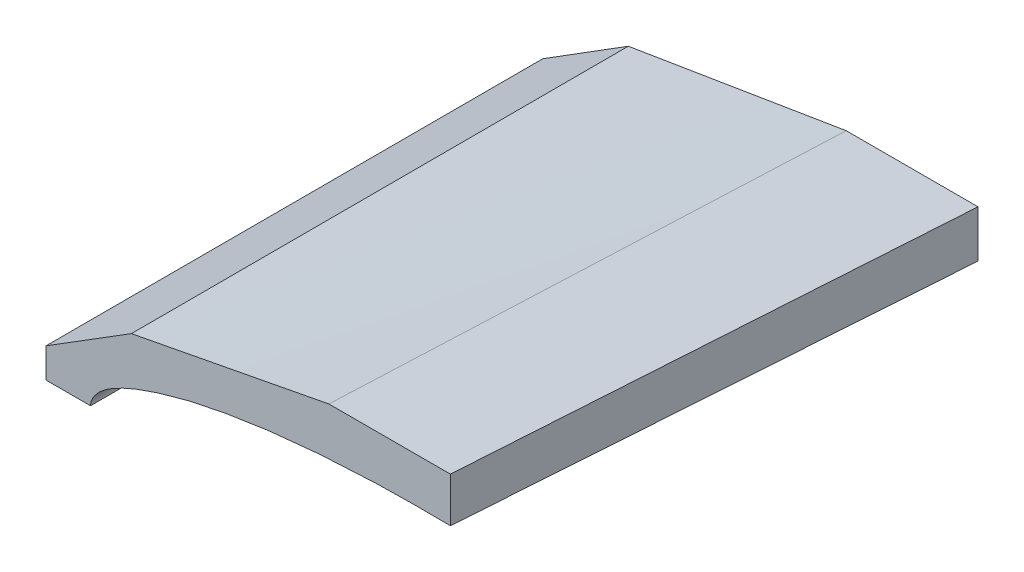
ISO-10303-21;
HEADER;
FILE_DESCRIPTION(('STEP AP214'),'2;1');
FILE_NAME('part.step','',(''),(''),'','','');
FILE_SCHEMA(('AUTOMOTIVE_DESIGN { 1 0 10303 214 1 1 1 1 }'));
ENDSEC;
DATA;
#1=APPLICATION_CONTEXT('core data for automotive mechanical design processes');
#2=APPLICATION_PROTOCOL_DEFINITION('international standard','automotive_design',2000,#1);
#3=PRODUCT_CONTEXT('',#1,'mechanical');
#4=PRODUCT('Part','Part','',(#3));
#5=PRODUCT_RELATED_PRODUCT_CATEGORY('part','',(#4));
#6=PRODUCT_DEFINITION_FORMATION('','',#4);
#7=PRODUCT_DEFINITION_CONTEXT('part definition',#1,'design');
#8=PRODUCT_DEFINITION('design','',#6,#7);
#9=PRODUCT_DEFINITION_SHAPE('','',#8);
#10=(LENGTH_UNIT() NAMED_UNIT(*) SI_UNIT(.MILLI.,.METRE.));
#11=(NAMED_UNIT(*) PLANE_ANGLE_UNIT() SI_UNIT($,.RADIAN.));
#12=(NAMED_UNIT(*) SI_UNIT($,.STERADIAN.) SOLID_ANGLE_UNIT());
#13=UNCERTAINTY_MEASURE_WITH_UNIT(LENGTH_MEASURE(1.E-05),#10,'distance_accuracy_value','');
#14=(GEOMETRIC_REPRESENTATION_CONTEXT(3) GLOBAL_UNCERTAINTY_ASSIGNED_CONTEXT((#13)) GLOBAL_UNIT_ASSIGNED_CONTEXT((#10,
#11,#12)) REPRESENTATION_CONTEXT('',''));
#15=CARTESIAN_POINT('',(0.,0.,0.));
#16=DIRECTION('',(0.,0.,1.));
#17=DIRECTION('',(1.,0.,0.));
#18=AXIS2_PLACEMENT_3D('',#15,#16,#17);
#19=CARTESIAN_POINT('',(0.,0.,619.76));
#20=DIRECTION('',(0.,0.,-1.));
#21=DIRECTION('',(-1.,0.,0.));
#22=AXIS2_PLACEMENT_3D('',#19,#20,#21);
#23=PLANE('',#22);
#24=CARTESIAN_POINT('',(16.665960034107,22.8320759672696,619.76));
#25=CARTESIAN_POINT('',(16.6659227791784,22.9515343249926,619.76));
#26=CARTESIAN_POINT('',(16.6723344853839,23.0708661366521,619.76));
#27=CARTESIAN_POINT('',(16.6967539549333,23.3080479413481,619.76));
#28=CARTESIAN_POINT('',(16.714732017644,23.4259009437427,619.76));
#29=CARTESIAN_POINT('',(16.7606665554886,23.6578573724142,619.76));
#30=CARTESIAN_POINT('',(16.7884776347151,23.7719902817547,619.76));
#31=CARTESIAN_POINT('',(16.852866783448,23.9978212473647,619.76));
#32=CARTESIAN_POINT('',(16.8894517901836,24.1095173002751,619.76));
#33=CARTESIAN_POINT('',(16.9913973640337,24.3880103026636,619.76));
#34=CARTESIAN_POINT('',(17.0617844741122,24.552969114425,619.76));
#35=CARTESIAN_POINT('',(17.2166279761935,24.8760930485377,619.76));
#36=CARTESIAN_POINT('',(17.3010898384224,25.0342554992669,619.76));
#37=CARTESIAN_POINT('',(17.4820774489066,25.3452475680357,619.76));
#38=CARTESIAN_POINT('',(17.5786984729781,25.498021306276,619.76));
#39=CARTESIAN_POINT('',(17.7812845603843,25.7971862555646,619.76));
#40=CARTESIAN_POINT('',(17.8872493060126,25.9435776833725,619.76));
#41=CARTESIAN_POINT('',(18.1050876751946,26.2280245366521,619.76));
#42=CARTESIAN_POINT('',(18.2168338887334,26.3661780454593,619.76));
#43=CARTESIAN_POINT('',(18.4466732242986,26.6371271944005,619.76));
#44=CARTESIAN_POINT('',(18.5647675907342,26.7699217750422,619.76));
#45=CARTESIAN_POINT('',(18.806488073043,27.0305262184775,619.76));
#46=CARTESIAN_POINT('',(18.9301178003879,27.1583327220319,619.76));
#47=CARTESIAN_POINT('',(19.182181427235,27.40911965662,619.76));
#48=CARTESIAN_POINT('',(19.3106155622858,27.532099850424,619.76));
#49=CARTESIAN_POINT('',(19.5716591482447,27.7732687536413,619.76));
#50=CARTESIAN_POINT('',(19.7042642380911,27.8914621902938,619.76));
#51=CARTESIAN_POINT('',(19.9734226606324,28.1232614578912,619.76));
#52=CARTESIAN_POINT('',(20.1099759920288,28.2368672903448,619.76));
#53=CARTESIAN_POINT('',(20.3867296777164,28.4593579014742,619.76));
#54=CARTESIAN_POINT('',(20.5269276161198,28.5682456860406,619.76));
#55=CARTESIAN_POINT('',(20.8107967837909,28.7813887484897,619.76));
#56=CARTESIAN_POINT('',(20.9544680046136,28.8856440376343,619.76));
#57=CARTESIAN_POINT('',(21.271079431314,29.1080182717573,619.76));
#58=CARTESIAN_POINT('',(21.444636677757,29.2252585687485,619.76));
#59=CARTESIAN_POINT('',(21.7955193560897,29.4539527402285,619.76));
#60=CARTESIAN_POINT('',(21.9728449415277,29.5654063782889,619.76));
#61=CARTESIAN_POINT('',(22.3307730192864,29.783383900817,619.76));
#62=CARTESIAN_POINT('',(22.51137909715,29.8899018752347,619.76));
#63=CARTESIAN_POINT('',(22.8749958887722,30.0987550806926,619.76));
#64=CARTESIAN_POINT('',(23.0580067084043,30.2010901267505,619.76));
#65=CARTESIAN_POINT('',(23.4263151593136,30.4024462433536,619.76));
#66=CARTESIAN_POINT('',(23.6116166565443,30.501460218106,619.76));
#67=CARTESIAN_POINT('',(23.983628222924,30.6967981121798,619.76));
#68=CARTESIAN_POINT('',(24.1703382900319,30.7931220353984,619.76));
#69=CARTESIAN_POINT('',(24.5452842004309,30.9832795614303,619.76));
#70=CARTESIAN_POINT('',(24.7335215101634,31.0771102743069,619.76));
#71=CARTESIAN_POINT('',(25.1113099149622,31.2620824496605,619.76));
#72=CARTESIAN_POINT('',(25.3008609936998,31.3532239454878,619.76));
#73=CARTESIAN_POINT('',(25.6811770474025,31.5328480249656,619.76));
#74=CARTESIAN_POINT('',(25.8719418005138,31.6213310785528,619.76));
#75=CARTESIAN_POINT('',(26.2545870967271,31.795850728716,619.76));
#76=CARTESIAN_POINT('',(26.4464676509395,31.8818873008812,619.76));
#77=CARTESIAN_POINT('',(27.0272053800327,32.1381810678181,619.76));
#78=CARTESIAN_POINT('',(27.417606171036,32.3049529148134,619.76));
#79=CARTESIAN_POINT('',(28.2013876528697,32.6295156843168,619.76));
#80=CARTESIAN_POINT('',(28.594762644169,32.7873204138334,619.76));
#81=CARTESIAN_POINT('',(29.3842477256794,33.094787568888,619.76));
#82=CARTESIAN_POINT('',(29.78035486986,33.2444575706747,619.76));
#83=CARTESIAN_POINT('',(30.575088001444,33.5364088071205,619.76));
#84=CARTESIAN_POINT('',(30.9737128496114,33.678693147801,619.76));
#85=CARTESIAN_POINT('',(31.7733072757596,33.9565052356436,619.76));
#86=CARTESIAN_POINT('',(32.1742768712582,34.0920329322543,619.76));
#87=CARTESIAN_POINT('',(33.2465290696052,34.4454765238598,619.76));
#88=CARTESIAN_POINT('',(33.9195917600936,34.6580015761432,619.76));
#89=CARTESIAN_POINT('',(34.9322808913655,34.9666088174163,619.76));
#90=CARTESIAN_POINT('',(35.2703747399567,35.0677854059543,619.76));
#91=CARTESIAN_POINT('',(35.9474568084376,35.2671062945931,619.76));
#92=CARTESIAN_POINT('',(36.286445028249,35.3652505949591,619.76));
#93=CARTESIAN_POINT('',(36.9655155894516,35.5590486569331,619.76));
#94=CARTESIAN_POINT('',(37.3055987055905,35.6546996977065,619.76));
#95=CARTESIAN_POINT('',(37.9864647369746,35.8434769675496,619.76));
#96=CARTESIAN_POINT('',(38.3272476511893,35.9366032003348,619.76));
#97=CARTESIAN_POINT('',(39.0095006090151,36.1202535859246,619.76));
#98=CARTESIAN_POINT('',(39.350970626501,36.2107778357348,619.76));
#99=CARTESIAN_POINT('',(40.0345997945118,36.3891825481117,619.76));
#100=CARTESIAN_POINT('',(40.3767589450873,36.4770630104845,619.76));
#101=CARTESIAN_POINT('',(41.4044103385466,36.7367504791165,619.76));
#102=CARTESIAN_POINT('',(42.090917694351,36.9045607919252,619.76));
#103=CARTESIAN_POINT('',(43.4664860375272,37.2293749749099,619.76));
#104=CARTESIAN_POINT('',(44.1555470470103,37.3863787512837,619.76));
#105=CARTESIAN_POINT('',(45.5318055553834,37.6891467102637,619.76));
#106=CARTESIAN_POINT('',(46.2189895005607,37.8349725738346,619.76));
#107=CARTESIAN_POINT('',(47.5953203908729,38.1170292011466,619.76));
#108=CARTESIAN_POINT('',(48.2844673367316,38.2532599613494,619.76));
#109=CARTESIAN_POINT('',(49.6641554959458,38.5167946853667,619.76));
#110=CARTESIAN_POINT('',(50.3546959815321,38.6441024661091,619.76));
#111=CARTESIAN_POINT('',(51.7372465230622,38.8904517902657,619.76));
#112=CARTESIAN_POINT('',(52.4292565774616,39.0094933423628,619.76));
#113=CARTESIAN_POINT('',(53.8144573313443,39.2399716866325,619.76));
#114=CARTESIAN_POINT('',(54.5076478855542,39.3514093537431,619.76));
#115=CARTESIAN_POINT('',(55.8950999914995,39.5674032125942,619.76));
#116=CARTESIAN_POINT('',(56.5893615468818,39.6719593808488,619.76));
#117=CARTESIAN_POINT('',(58.1738631632866,39.9030932178647,619.76));
#118=CARTESIAN_POINT('',(59.0644038832587,40.0276125837368,619.76));
#119=CARTESIAN_POINT('',(60.8468377972239,40.2665526900433,619.76));
#120=CARTESIAN_POINT('',(61.738730993553,40.3809734130141,619.76));
#121=CARTESIAN_POINT('',(63.5238656963679,40.6001218836591,619.76));
#122=CARTESIAN_POINT('',(64.4171074121392,40.7048479254907,619.76));
#123=CARTESIAN_POINT('',(66.2046128410229,40.9051384798762,619.76));
#124=CARTESIAN_POINT('',(67.0988765544319,41.00070298977,619.76));
#125=CARTESIAN_POINT('',(69.7835622852592,41.2743897464644,619.76));
#126=CARTESIAN_POINT('',(71.57533098496,41.4394385632644,619.76));
#127=CARTESIAN_POINT('',(75.1621445893644,41.7372145256928,619.76));
#128=CARTESIAN_POINT('',(76.9571904121269,41.8699304842608,619.76));
#129=CARTESIAN_POINT('',(80.5498040362813,42.1050854346535,619.76));
#130=CARTESIAN_POINT('',(82.3473724308305,42.2075153709218,619.76));
#131=CARTESIAN_POINT('',(85.0449329846407,42.3397262246504,619.76));
#132=CARTESIAN_POINT('',(85.9444150905544,42.380227275064,619.76));
#133=CARTESIAN_POINT('',(87.7436682700613,42.4542550557693,619.76));
#134=CARTESIAN_POINT('',(88.6434393436139,42.4877817870386,619.76));
#135=CARTESIAN_POINT('',(90.4461003044805,42.54804785384,619.76));
#136=CARTESIAN_POINT('',(91.3489909303996,42.5747650525331,619.76));
#137=CARTESIAN_POINT('',(93.1549461919199,42.6213858818135,619.76));
#138=CARTESIAN_POINT('',(94.0580108275114,42.6412895127804,619.76));
#139=CARTESIAN_POINT('',(96.7671533879806,42.6910225070651,619.76));
#140=CARTESIAN_POINT('',(98.5734228319868,42.7108820082124,619.76));
#141=CARTESIAN_POINT('',(102.185385028637,42.7256192013648,619.76));
#142=CARTESIAN_POINT('',(103.991077749996,42.7205060471863,619.76));
#143=CARTESIAN_POINT('',(107.601082985515,42.6872559690035,619.76));
#144=CARTESIAN_POINT('',(109.405395639632,42.6591338746658,619.76));
#145=CARTESIAN_POINT('',(113.011820797219,42.5817188180775,619.76));
#146=CARTESIAN_POINT('',(114.813933748009,42.5324462387965,619.76));
#147=CARTESIAN_POINT('',(118.415158411196,42.4146458804337,619.76));
#148=CARTESIAN_POINT('',(120.214270951344,42.3461435363149,619.76));
#149=CARTESIAN_POINT('',(122.012987748225,42.2689138855527,619.76));
#150=B_SPLINE_CURVE_WITH_KNOTS('',3,(#24,#25,#26,#27,#28,#29,#30,#31,#32,#33,#34,#35,#36,#37,
#38,#39,#40,#41,#42,#43,#44,#45,#46,#47,#48,#49,#50,#51,#52,#53,#54,#55,#56,#57,#58,#59,#60,#61,
#62,#63,#64,#65,#66,#67,#68,#69,#70,#71,#72,#73,#74,#75,#76,#77,#78,#79,#80,#81,#82,#83,#84,#85,
#86,#87,#88,#89,#90,#91,#92,#93,#94,#95,#96,#97,#98,#99,#100,#101,#102,#103,#104,#105,#106,#107,
#108,#109,#110,#111,#112,#113,#114,#115,#116,#117,#118,#119,#120,#121,#122,#123,#124,#125,#126,
#127,#128,#129,#130,#131,#132,#133,#134,#135,#136,#137,#138,#139,#140,#141,#142,#143,#144,#145,
#146,#147,#148,#149),.UNSPECIFIED.,.F.,.F.,(4,2,2,2,2,2,2,2,2,2,2,2,2,2,2,2,2,2,2,2,2,2,2,2,2,2,
2,2,2,2,2,2,2,2,2,2,2,2,2,2,2,2,2,2,2,2,2,2,2,2,2,2,2,2,2,2,2,2,2,2,2,2,4),(0.,
0.358016402443774,0.715117123160665,1.06714438012292,1.41945089538607,1.95660428829693,
2.49396693768478,3.03583832519601,3.57769129501844,4.11054243684564,4.64349841551955,
5.17680733080014,5.710142427297,6.24293729481199,6.77573198711225,7.30818208644165,
7.84063089127882,8.46883571540445,9.09706618623623,9.72603043630284,10.3550224711377,
10.9852823686839,11.6155413530851,12.2465015563458,12.8774539314685,13.5082941080275,
14.1391405768458,15.4126058896768,16.6840540840776,17.954297081048,19.2240014790076,
20.4937153751423,22.6109601125162,23.669675723005,24.7283912409068,25.7882174539727,
26.8480421072989,27.9078271975439,28.9676123655738,31.087676112534,33.2077582596018,
35.3151435817007,37.4225296809052,39.5290087442026,41.6354855948273,43.7417196544108,
45.8479609020015,48.5455100409732,51.2430638447189,53.9410914020704,56.639119742825,
62.0368319765874,67.4364091567247,72.8375991879442,75.5387580160883,78.2399164656526,
80.9497471134608,83.6595776102905,89.0785096818168,94.4954555734407,99.9089128958355,
105.31716487757,110.718296869144),.UNSPECIFIED.);
#151=CARTESIAN_POINT('',(16.6659600333715,22.832075966541,619.759999987446));
#152=VERTEX_POINT('',#151);
#153=CARTESIAN_POINT('',(122.012987748225,42.2689138855518,619.759999999985));
#154=VERTEX_POINT('',#153);
#155=EDGE_CURVE('E398',#152,#154,#150,.T.);
#156=ORIENTED_EDGE('',*,*,#155,.F.);
#157=DIRECTION('',(1.,1.57642995879392E-13,0.));
#158=VECTOR('',#157,1.);
#159=CARTESIAN_POINT('',(10.665960034107,22.832075967269,619.76));
#160=LINE('',#159,#158);
#161=CARTESIAN_POINT('',(4.66596003410702,22.832075967269,619.76));
#162=VERTEX_POINT('',#161);
#163=EDGE_CURVE('E400',#162,#152,#160,.T.);
#164=ORIENTED_EDGE('',*,*,#163,.F.);
#165=DIRECTION('',(0.,-1.,0.));
#166=VECTOR('',#165,1.);
#167=CARTESIAN_POINT('',(4.66596003410703,26.832075967269,619.76));
#168=LINE('',#167,#166);
#169=CARTESIAN_POINT('',(4.66596003410702,30.832075967269,619.76));
#170=VERTEX_POINT('',#169);
#171=EDGE_CURVE('E356',#170,#162,#168,.T.);
#172=ORIENTED_EDGE('',*,*,#171,.F.);
#173=CARTESIAN_POINT('',(27.7426653956149,45.2985848282577,619.76));
#174=CARTESIAN_POINT('',(25.805618886762,44.0842736843797,619.76));
#175=CARTESIAN_POINT('',(23.8685723779092,42.8699625405018,619.76));
#176=CARTESIAN_POINT('',(19.9944793602034,40.4413402527459,619.76));
#177=CARTESIAN_POINT('',(18.0574328513505,39.2270291088679,619.76));
#178=CARTESIAN_POINT('',(12.3022442397007,35.6191706324163,619.76));
#179=CARTESIAN_POINT('',(8.48410213690386,33.2256232998427,619.76));
#180=CARTESIAN_POINT('',(4.66596003410702,30.832075967269,619.76));
#181=B_SPLINE_CURVE_WITH_KNOTS('',3,(#173,#174,#175,#176,#177,#178,#179,#180),.UNSPECIFIED.,.F.,
.F.,(4,2,2,4),(0.,6.85859363021663,13.7171872604333,27.2362664285491),.UNSPECIFIED.);
#182=CARTESIAN_POINT('',(27.7426653956149,45.2985848282577,619.76));
#183=VERTEX_POINT('',#182);
#184=EDGE_CURVE('E409',#183,#170,#181,.T.);
#185=ORIENTED_EDGE('',*,*,#184,.F.);
#186=CARTESIAN_POINT('',(86.4898868993153,54.9460232350262,619.76));
#187=CARTESIAN_POINT('',(80.7092369260384,53.9967278787383,619.76));
#188=CARTESIAN_POINT('',(74.9285869527614,53.0474325224505,619.76));
#189=CARTESIAN_POINT('',(63.3672870062075,51.1488418098747,619.76));
#190=CARTESIAN_POINT('',(57.5866370329305,50.1995464535869,619.76));
#191=CARTESIAN_POINT('',(43.7848798383074,47.9330290076186,619.76));
#192=CARTESIAN_POINT('',(35.7637726169612,46.6158069179381,619.76));
#193=CARTESIAN_POINT('',(27.7426653956149,45.2985848282577,619.76));
#194=B_SPLINE_CURVE_WITH_KNOTS('',3,(#186,#187,#188,#189,#190,#191,#192,#193),.UNSPECIFIED.,.F.,
.F.,(4,2,2,4),(0.,17.5742334707136,35.1484669414271,59.5341003309635),.UNSPECIFIED.);
#195=CARTESIAN_POINT('',(86.4898868992629,54.9460232348613,619.759999997304));
#196=VERTEX_POINT('',#195);
#197=EDGE_CURVE('E125',#196,#183,#194,.T.);
#198=ORIENTED_EDGE('',*,*,#197,.F.);
#199=DIRECTION('',(-1.,0.,0.));
#200=VECTOR('',#199,1.);
#201=CARTESIAN_POINT('',(111.489886899315,54.9460232350262,619.76));
#202=LINE('',#201,#200);
#203=CARTESIAN_POINT('',(122.012987748225,54.9460232350253,619.759999999985));
#204=VERTEX_POINT('',#203);
#205=EDGE_CURVE('E118',#204,#196,#202,.T.);
#206=ORIENTED_EDGE('',*,*,#205,.F.);
#207=DIRECTION('',(0.,-1.,0.));
#208=VECTOR('',#207,1.);
#209=CARTESIAN_POINT('',(122.012987748225,0.,619.76));
#210=LINE('',#209,#208);
#211=EDGE_CURVE('E130',#204,#154,#210,.T.);
#212=ORIENTED_EDGE('',*,*,#211,.T.);
#213=EDGE_LOOP('',(#156,#164,#172,#185,#198,#206,#212));
#214=FACE_BOUND('',#213,.T.);
#215=ADVANCED_FACE('F44',(#214),#23,.T.);
#216=CARTESIAN_POINT('',(122.012987748225,6.34998004884585,335.28));
#217=DIRECTION('',(1.,0.,0.));
#218=DIRECTION('',(0.,1.,0.));
#219=AXIS2_PLACEMENT_3D('',#216,#217,#218);
#220=PLANE('',#219);
#221=CARTESIAN_POINT('',(122.012987748225,42.2689138855518,619.759999999985));
#222=CARTESIAN_POINT('',(122.012987748225,43.0449286767758,631.613383838207));
#223=CARTESIAN_POINT('',(122.012987748225,43.8211244635662,643.466755827629));
#224=CARTESIAN_POINT('',(122.012987748225,45.373895579959,667.173474933267));
#225=CARTESIAN_POINT('',(122.012987748225,46.150470909561,679.026822049482));
#226=CARTESIAN_POINT('',(122.012987748225,47.7040186650179,702.733490260003));
#227=CARTESIAN_POINT('',(122.012987748225,48.4809910908729,714.586811354309));
#228=CARTESIAN_POINT('',(122.012987748225,50.0353507213848,738.293426360589));
#229=CARTESIAN_POINT('',(122.012987748225,50.8127379260422,750.146720272562));
#230=CARTESIAN_POINT('',(122.012987748225,51.5903413605131,762.));
#231=B_SPLINE_CURVE_WITH_KNOTS('',3,(#221,#222,#223,#224,#225,#226,#227,#228,#229,#230),
.UNSPECIFIED.,.F.,.F.,(4,2,2,2,4),(0.,35.6362759882764,71.2725519365494,106.90882788571,
142.545103874873),.UNSPECIFIED.);
#232=CARTESIAN_POINT('',(122.012985594409,51.5902087951168,762.));
#233=VERTEX_POINT('',#232);
#234=EDGE_CURVE('E137',#154,#233,#231,.T.);
#235=ORIENTED_EDGE('',*,*,#234,.F.);
#236=ORIENTED_EDGE('',*,*,#211,.F.);
#237=CARTESIAN_POINT('',(122.012987748225,63.6548897190743,761.999999999999));
#238=CARTESIAN_POINT('',(122.012987748225,62.6352649018501,745.364551576616));
#239=CARTESIAN_POINT('',(122.012987748225,61.6160439518045,728.729078401939));
#240=CARTESIAN_POINT('',(122.012987748225,59.5783642213013,695.458085396377));
#241=CARTESIAN_POINT('',(122.012987748225,58.5599054408426,678.822565565492));
#242=CARTESIAN_POINT('',(122.012987748225,56.6762901019862,648.044698096347));
#243=CARTESIAN_POINT('',(122.012987748225,55.811034192517,633.902356538365));
#244=CARTESIAN_POINT('',(122.012987748225,54.9460232350253,619.759999999985));
#245=B_SPLINE_CURVE_WITH_KNOTS('',3,(#237,#238,#239,#240,#241,#242,#243,#244),.UNSPECIFIED.,.F.,
.F.,(4,2,2,4),(0.,50.0000001023951,100.00000013542,142.50635768178),.UNSPECIFIED.);
#246=CARTESIAN_POINT('',(122.012987748225,63.6548897190744,762.));
#247=VERTEX_POINT('',#246);
#248=EDGE_CURVE('E115',#247,#204,#245,.T.);
#249=ORIENTED_EDGE('',*,*,#248,.F.);
#250=DIRECTION('',(0.,1.,0.));
#251=VECTOR('',#250,1.);
#252=CARTESIAN_POINT('',(122.012987748225,51.6460530017887,762.));
#253=LINE('',#252,#251);
#254=EDGE_CURVE('E140',#233,#247,#253,.T.);
#255=ORIENTED_EDGE('',*,*,#254,.F.);
#256=EDGE_LOOP('',(#235,#236,#249,#255));
#257=FACE_BOUND('',#256,.T.);
#258=ADVANCED_FACE('F136',(#257),#220,.T.);
#259=CARTESIAN_POINT('',(111.477492972876,51.6460530017887,762.));
#260=DIRECTION('',(0.,0.,1.));
#261=DIRECTION('',(1.,0.,0.));
#262=AXIS2_PLACEMENT_3D('',#259,#260,#261);
#263=PLANE('',#262);
#264=CARTESIAN_POINT('',(24.9991434170329,31.0964008470047,762.));
#265=CARTESIAN_POINT('',(24.9991434170329,32.8522185997555,762.));
#266=CARTESIAN_POINT('',(27.4179385280924,35.8883177815517,762.));
#267=CARTESIAN_POINT('',(31.7474246399989,38.6970957891555,762.));
#268=CARTESIAN_POINT('',(36.9114443605116,41.1010380531441,762.));
#269=CARTESIAN_POINT('',(43.0205983099712,43.196106756929,762.));
#270=CARTESIAN_POINT('',(51.0869016729065,45.5261244373149,762.));
#271=CARTESIAN_POINT('',(61.2202621419313,47.6426880304369,762.));
#272=CARTESIAN_POINT('',(73.4103767098064,49.4367454088579,762.));
#273=CARTESIAN_POINT('',(85.5960193607886,50.65493632377,762.));
#274=CARTESIAN_POINT('',(101.842445598241,51.6369772628706,762.));
#275=CARTESIAN_POINT('',(122.19115115007,51.779158438112,762.));
#276=CARTESIAN_POINT('',(146.602283798461,50.7988495791154,762.));
#277=CARTESIAN_POINT('',(171.032045292284,49.130515531749,762.));
#278=CARTESIAN_POINT('',(189.770245111766,47.2530528113811,762.));
#279=CARTESIAN_POINT('',(200.370541836645,46.0279905449402,762.));
#280=CARTESIAN_POINT('',(202.839777129521,45.7338764691475,762.));
#281=B_SPLINE_CURVE_WITH_KNOTS('',3,(#264,#265,#266,#267,#268,#269,#270,#271,#272,#273,#274,
#275,#276,#277,#278,#279,#280),.UNSPECIFIED.,.F.,.F.,(4,1,1,1,1,1,1,1,1,1,1,1,1,1,4),
(0.498396826463848,0.509775276169533,0.5171599878226,0.530632991056939,0.543549577577208,
0.556240821475834,0.581224600668469,0.6059481928375,0.630547770922518,0.655086674698896,
0.704122821890936,0.753234226035596,0.802458299876464,0.851833076582463,0.866835397644884),.UNSPECIFIED.);
#282=CARTESIAN_POINT('',(24.999143417033,31.0964008470047,762.));
#283=VERTEX_POINT('',#282);
#284=EDGE_CURVE('E235',#283,#233,#281,.T.);
#285=ORIENTED_EDGE('',*,*,#284,.T.);
#286=ORIENTED_EDGE('',*,*,#254,.T.);
#287=DIRECTION('',(-1.,0.,0.));
#288=VECTOR('',#287,1.);
#289=CARTESIAN_POINT('',(89.2569280954942,63.6548897190744,762.));
#290=LINE('',#289,#288);
#291=CARTESIAN_POINT('',(89.2569280954942,63.6548897190744,762.));
#292=VERTEX_POINT('',#291);
#293=EDGE_CURVE('E71',#247,#292,#290,.T.);
#294=ORIENTED_EDGE('',*,*,#293,.T.);
#295=DIRECTION('',(-0.982151349950431,-0.188092333151954,0.));
#296=VECTOR('',#295,1.);
#297=CARTESIAN_POINT('',(36.0235205109394,53.46013120786,762.));
#298=LINE('',#297,#296);
#299=CARTESIAN_POINT('',(36.0235205109394,53.46013120786,762.));
#300=VERTEX_POINT('',#299);
#301=EDGE_CURVE('E228',#292,#300,#298,.T.);
#302=ORIENTED_EDGE('',*,*,#301,.T.);
#303=DIRECTION('',(-0.848436983087749,-0.529296406306484,0.));
#304=VECTOR('',#303,1.);
#305=CARTESIAN_POINT('',(12.999143417033,39.0964008470047,762.));
#306=LINE('',#305,#304);
#307=CARTESIAN_POINT('',(12.999143417033,39.0964008470047,762.));
#308=VERTEX_POINT('',#307);
#309=EDGE_CURVE('E207',#300,#308,#306,.T.);
#310=ORIENTED_EDGE('',*,*,#309,.T.);
#311=DIRECTION('',(0.,-1.,0.));
#312=VECTOR('',#311,1.);
#313=CARTESIAN_POINT('',(12.999143417033,31.0964008470047,762.));
#314=LINE('',#313,#312);
#315=CARTESIAN_POINT('',(12.999143417033,31.0964008470047,762.));
#316=VERTEX_POINT('',#315);
#317=EDGE_CURVE('E217',#308,#316,#314,.T.);
#318=ORIENTED_EDGE('',*,*,#317,.T.);
#319=DIRECTION('',(1.,0.,0.));
#320=VECTOR('',#319,1.);
#321=CARTESIAN_POINT('',(24.999143417033,31.0964008470047,762.));
#322=LINE('',#321,#320);
#323=EDGE_CURVE('E134',#316,#283,#322,.T.);
#324=ORIENTED_EDGE('',*,*,#323,.T.);
#325=EDGE_LOOP('',(#285,#286,#294,#302,#310,#318,#324));
#326=FACE_BOUND('',#325,.T.);
#327=ADVANCED_FACE('F168',(#326),#263,.T.);
#328=CARTESIAN_POINT('',(9.29077044004429E-07,6.34998004884775,335.28));
#329=CARTESIAN_POINT('',(8.33297207421032,14.5787844685806,477.52169947526));
#330=CARTESIAN_POINT('',(16.6660013893575,22.8228512171374,619.762103902452));
#331=CARTESIAN_POINT('',(24.9991434170329,31.0964008470047,762.));
#332=CARTESIAN_POINT('',(9.29077600369592E-07,7.45438325082316,335.28));
#333=CARTESIAN_POINT('',(8.33297207421069,15.6111681299376,477.52169947526));
#334=CARTESIAN_POINT('',(16.6660013893577,23.783215337876,619.762103902452));
#335=CARTESIAN_POINT('',(24.9991434170329,31.9847454271249,762.));
#336=CARTESIAN_POINT('',(0.969916519496457,9.6613167038059,335.28));
#337=CARTESIAN_POINT('',(9.22997388777417,17.6892352496878,477.521699475259));
#338=CARTESIAN_POINT('',(17.4900894260658,25.7324161243937,619.762103902451));
#339=CARTESIAN_POINT('',(25.7503176768857,33.8050798804101,762.));
#340=CARTESIAN_POINT('',(3.44848156516794,12.0366302116868,335.28));
#341=CARTESIAN_POINT('',(11.5121687647093,19.9379477005165,477.52169947526));
#342=CARTESIAN_POINT('',(19.5759141342645,27.8545275181702,619.762103902452));
#343=CARTESIAN_POINT('',(27.639772216348,35.8005902171344,762.000000000001));
#344=CARTESIAN_POINT('',(5.45941166538086,13.4428022435293,335.28));
#345=CARTESIAN_POINT('',(13.3630371949687,21.2745392258276,477.521699475259));
#346=CARTESIAN_POINT('',(21.2667208945703,29.1215385369498,619.762103902452));
#347=CARTESIAN_POINT('',(29.1705173067003,36.9980207293825,762.));
#348=CARTESIAN_POINT('',(6.98203766683405,14.316970710559,335.28));
#349=CARTESIAN_POINT('',(14.7696273274846,22.112594899526,477.52169947526));
#350=CARTESIAN_POINT('',(22.557275158149,29.923481417317,619.762103902452));
#351=CARTESIAN_POINT('',(30.3450357013417,37.7638508164184,762.));
#352=CARTESIAN_POINT('',(8.54472942418297,15.0888371575498,335.28));
#353=CARTESIAN_POINT('',(16.217370772052,22.8607836546203,477.52169947526));
#354=CARTESIAN_POINT('',(23.8900702899349,30.6479924805147,619.762103902452));
#355=CARTESIAN_POINT('',(31.5628825203461,38.4646841877197,762.));
#356=CARTESIAN_POINT('',(10.1582127248828,15.8184229079955,335.28));
#357=CARTESIAN_POINT('',(17.7118720922566,23.5698254554367,477.521699475259));
#358=CARTESIAN_POINT('',(25.2655896296443,31.3364903317018,619.762103902451));
#359=CARTESIAN_POINT('',(32.8194198795603,39.1326380892775,761.999999999999));
#360=CARTESIAN_POINT('',(11.8098506399446,16.4960217707987,335.28));
#361=CARTESIAN_POINT('',(19.2427460811811,24.2313837922629,477.521699475261));
#362=CARTESIAN_POINT('',(26.6756996924314,31.9820081425512,619.762103902453));
#363=CARTESIAN_POINT('',(34.1087660162101,39.76211537415,762.000000000002));
#364=CARTESIAN_POINT('',(13.4900691645311,17.1289319071832,335.28));
#365=CARTESIAN_POINT('',(20.801220906549,24.8518102555458,477.521699475259));
#366=CARTESIAN_POINT('',(28.1124308185809,32.5899509327323,619.762103902451));
#367=CARTESIAN_POINT('',(35.423753443141,40.3575744912294,761.999999999999));
#368=CARTESIAN_POINT('',(15.1903900958544,17.7169000721208,335.28));
#369=CARTESIAN_POINT('',(22.3776261706481,25.4304482833263,477.52169947526));
#370=CARTESIAN_POINT('',(29.5649204154557,33.1592588233557,619.762103902452));
#371=CARTESIAN_POINT('',(36.7523273727916,40.9175522446957,761.999999999999));
#372=CARTESIAN_POINT('',(17.465921328655,18.443907318319,335.28));
#373=CARTESIAN_POINT('',(24.4893873514633,26.1494155039185,477.52169947526));
#374=CARTESIAN_POINT('',(31.5129115442856,33.870186018342,619.762103902453));
#375=CARTESIAN_POINT('',(38.5365484496361,41.620439414076,762.000000000001));
#376=CARTESIAN_POINT('',(20.3261253650035,19.2567063001384,335.28));
#377=CARTESIAN_POINT('',(27.1442798687524,26.9590316546654,477.521699475259));
#378=CARTESIAN_POINT('',(33.9624925425152,34.6766193380163,619.76210390245));
#379=CARTESIAN_POINT('',(40.7808179288063,42.4236899026778,761.999999999998));
#380=CARTESIAN_POINT('',(23.7782685903277,20.118367205322,335.28));
#381=CARTESIAN_POINT('',(30.3520648212409,27.826403434635,477.52169947526));
#382=CARTESIAN_POINT('',(36.9259192221679,35.549701992772,619.762103902453));
#383=CARTESIAN_POINT('',(43.4998863356233,43.3024834322195,762.000000000001));
#384=CARTESIAN_POINT('',(27.2569743923509,20.9064140542042,335.28));
#385=CARTESIAN_POINT('',(33.5853102584017,28.6257194399167,477.52169947526));
#386=CARTESIAN_POINT('',(39.9137042944664,36.3602871544532,619.762103902451));
#387=CARTESIAN_POINT('',(46.2422110430595,44.1243377503001,761.999999999999));
#388=CARTESIAN_POINT('',(30.7542530905361,21.6165466303187,335.279999999999));
#389=CARTESIAN_POINT('',(36.8375774721128,29.3523453451718,477.521699475259));
#390=CARTESIAN_POINT('',(42.9209600237033,37.103406388849,619.762103902451));
#391=CARTESIAN_POINT('',(49.0044552878221,44.8839503138367,762.));
#392=CARTESIAN_POINT('',(34.2664636940487,22.2460759079554,335.280000000001));
#393=CARTESIAN_POINT('',(40.1050244166742,30.0039988320751,477.52169947526));
#394=CARTESIAN_POINT('',(45.9436433093136,37.7771840850187,619.762103902452));
#395=CARTESIAN_POINT('',(51.7823749144814,45.579852219273,762.));
#396=CARTESIAN_POINT('',(37.7902260736038,22.8004936568621,335.279999999999));
#397=CARTESIAN_POINT('',(43.384705041758,30.5859470440672,477.521699475259));
#398=CARTESIAN_POINT('',(48.979242179926,38.3866627600962,619.762103902451));
#399=CARTESIAN_POINT('',(54.5738920306224,46.2168613574358,761.999999999999));
#400=CARTESIAN_POINT('',(41.3242497765985,23.2878811261495,335.28));
#401=CARTESIAN_POINT('',(46.675131793767,31.1056757552862,477.52169947526));
#402=CARTESIAN_POINT('',(52.0260719809494,38.9387327132469,619.762103902453));
#403=CARTESIAN_POINT('',(57.3771248806601,46.8012725525181,762.000000000001));
#404=CARTESIAN_POINT('',(44.8658239828752,23.7149223381359,335.28));
#405=CARTESIAN_POINT('',(49.9736457372606,31.5693936302263,477.521699475259));
#406=CARTESIAN_POINT('',(55.0815256616599,39.4391272511406,619.762103902451));
#407=CARTESIAN_POINT('',(60.1895182985876,47.3383437533655,761.999999999999));
#408=CARTESIAN_POINT('',(48.4136829142244,24.0896238833925,335.28));
#409=CARTESIAN_POINT('',(53.2790352364492,31.9845911908484,477.52169947526));
#410=CARTESIAN_POINT('',(58.144445728688,39.8948208271283,619.762103902453));
#411=CARTESIAN_POINT('',(63.009968933455,47.8345333447187,762.000000000001));
#412=CARTESIAN_POINT('',(53.1486242463732,24.5260190039242,335.28));
#413=CARTESIAN_POINT('',(57.6912752508218,32.4792550117327,477.521699475259));
#414=CARTESIAN_POINT('',(62.2339844252844,40.4477533483652,619.762103902451));
#415=CARTESIAN_POINT('',(66.7768063122753,48.4457345663082,761.999999999999));
#416=CARTESIAN_POINT('',(59.0789436792651,24.9574757661192,335.28));
#417=CARTESIAN_POINT('',(63.2200221820315,32.9915421905065,477.52169947526));
#418=CARTESIAN_POINT('',(67.3611588548119,41.0408709437178,619.762103902453));
#419=CARTESIAN_POINT('',(71.5024082401206,49.1196825782396,762.000000000001));
#420=CARTESIAN_POINT('',(66.2030814892412,25.3140522243183,335.28));
#421=CARTESIAN_POINT('',(69.8642211934628,33.4561192258002,477.52169947526));
#422=CARTESIAN_POINT('',(73.5254190676983,41.613448556106,619.762103902451));
#423=CARTESIAN_POINT('',(77.1867296544622,49.8002607677224,761.999999999999));
#424=CARTESIAN_POINT('',(73.3339674682549,25.523312736422,335.279999999999));
#425=CARTESIAN_POINT('',(76.5177056557658,33.7833803999775,477.52169947526));
#426=CARTESIAN_POINT('',(79.7015020132907,42.0587103923571,619.762103902452));
#427=CARTESIAN_POINT('',(82.8854110833438,50.3635232660471,762.000000000001));
#428=CARTESIAN_POINT('',(80.4669900342226,25.5957976291351,335.280000000001));
#429=CARTESIAN_POINT('',(83.1755672296286,33.9831036079315,477.52169947526));
#430=CARTESIAN_POINT('',(85.8842025950485,42.3856719155519,619.762103902451));
#431=CARTESIAN_POINT('',(88.5929506729966,50.8177231044828,761.999999999999));
#432=CARTESIAN_POINT('',(87.6002131526684,25.5406730290278,335.279999999999));
#433=CARTESIAN_POINT('',(89.8360561254533,34.0637012643954,477.521699475259));
#434=CARTESIAN_POINT('',(92.071957268252,42.6019918285869,619.762103902452));
#435=CARTESIAN_POINT('',(94.3079711235791,51.1697652740891,762.));
#436=CARTESIAN_POINT('',(94.731344048156,25.3623320865792,335.28));
#437=CARTESIAN_POINT('',(96.4968287829496,34.0292359395454,477.52169947526));
#438=CARTESIAN_POINT('',(98.262371687757,42.7114021213355,619.762103902453));
#439=CARTESIAN_POINT('',(100.028027305093,51.4230511844363,762.000000000001));
#440=CARTESIAN_POINT('',(101.858719846003,25.0679177013017,335.28));
#441=CARTESIAN_POINT('',(103.156275912104,33.8864442696627,477.521699475259));
#442=CARTESIAN_POINT('',(104.453890148219,42.7202331668477,619.762103902451));
#443=CARTESIAN_POINT('',(105.751617096862,51.5835049453433,761.999999999999));
#444=CARTESIAN_POINT('',(108.98145520224,24.6671471282029,335.28));
#445=CARTESIAN_POINT('',(109.813353159231,33.6444202192184,477.52169947526));
#446=CARTESIAN_POINT('',(110.645309286237,42.6369556390579,619.762103902452));
#447=CARTESIAN_POINT('',(111.477378125771,51.6589739402079,762.));
#448=CARTESIAN_POINT('',(116.098371799005,24.1694505600281,335.28));
#449=CARTESIAN_POINT('',(116.466790352252,33.3119415656027,477.521699475259));
#450=CARTESIAN_POINT('',(116.835267075513,42.4696949000013,619.762103902452));
#451=CARTESIAN_POINT('',(117.203856511302,51.6569311157104,762.));
#452=CARTESIAN_POINT('',(123.208750062991,23.5842845444573,335.280000000001));
#453=CARTESIAN_POINT('',(123.115731295253,32.8978674091282,477.52169947526));
#454=CARTESIAN_POINT('',(123.022770697529,42.2267126026231,619.762103902452));
#455=CARTESIAN_POINT('',(122.929922812333,51.5850406774286,762.));
#456=CARTESIAN_POINT('',(130.310988961638,22.921250348438,335.279999999999));
#457=CARTESIAN_POINT('',(129.758512205833,32.411084966105,477.521699475259));
#458=CARTESIAN_POINT('',(129.206093620042,41.9161819125961,619.762103902451));
#459=CARTESIAN_POINT('',(128.65378774678,51.4507617403976,761.999999999999));
#460=CARTESIAN_POINT('',(137.406778455928,22.1873993770708,335.28));
#461=CARTESIAN_POINT('',(136.396633479512,31.8582341206284,477.52169947526));
#462=CARTESIAN_POINT('',(135.38654667311,41.54433119301,619.762103902452));
#463=CARTESIAN_POINT('',(134.376572579236,51.2599111467022,762.));
#464=CARTESIAN_POINT('',(144.494202314858,21.3909417632401,335.28));
#465=CARTESIAN_POINT('',(143.028083804604,31.2468918148837,477.521699475259));
#466=CARTESIAN_POINT('',(141.562023464364,41.1181041953513,619.762103902451));
#467=CARTESIAN_POINT('',(140.096075836652,51.0187994571294,761.999999999999));
#468=CARTESIAN_POINT('',(153.939247988962,20.2535758150893,335.280000000001));
#469=CARTESIAN_POINT('',(151.866994129968,30.3616126018442,477.52169947526));
#470=CARTESIAN_POINT('',(149.794798440988,40.4849117174231,619.762103902452));
#471=CARTESIAN_POINT('',(147.722715464536,50.6376937143126,762.));
#472=CARTESIAN_POINT('',(165.724997703164,18.7151343960646,335.279999999999));
#473=CARTESIAN_POINT('',(162.898490334251,29.1457414177919,477.521699475259));
#474=CARTESIAN_POINT('',(160.072041135351,39.5916107683432,619.762103902452));
#475=CARTESIAN_POINT('',(157.24570464898,50.066963000205,762.));
#476=CARTESIAN_POINT('',(179.846765687905,16.6757724994209,335.28));
#477=CARTESIAN_POINT('',(176.120250526412,27.5053845131493,477.52169947526));
#478=CARTESIAN_POINT('',(172.393793534932,38.3502588557017,619.762103902452));
#479=CARTESIAN_POINT('',(168.667449255981,49.2246160795646,762.));
#480=CARTESIAN_POINT('',(193.933550227643,14.4286098676329,335.28));
#481=CARTESIAN_POINT('',(189.313154974693,25.670161061974,477.52169947526));
#482=CARTESIAN_POINT('',(184.692817891756,36.926974585139,619.762103902452));
#483=CARTESIAN_POINT('',(180.072593521347,48.2132709896145,762.));
#484=CARTESIAN_POINT('',(207.990516041457,11.9899167572326,335.28));
#485=CARTESIAN_POINT('',(202.481883538507,23.6559759384714,477.52169947526));
#486=CARTESIAN_POINT('',(196.97330920557,35.3372974485342,619.762103902452));
#487=CARTESIAN_POINT('',(191.464847585162,47.0481018399075,762.));
#488=CARTESIAN_POINT('',(217.341938436305,10.2573401873864,335.28));
#489=CARTESIAN_POINT('',(211.244446134889,22.2133306080831,477.52169947526));
#490=CARTESIAN_POINT('',(205.147012003487,34.1845833576038,619.762103902452));
#491=CARTESIAN_POINT('',(199.049690584614,46.1853189884351,762.));
#492=CARTESIAN_POINT('',(222.012987748225,9.36643436036436,335.28));
#493=CARTESIAN_POINT('',(215.621841191138,21.4689125503059,477.52169947526));
#494=CARTESIAN_POINT('',(209.230752804065,33.5866530690714,619.762103902452));
#495=CARTESIAN_POINT('',(202.839777129521,45.7338764691475,762.));
#496=B_SPLINE_SURFACE_WITH_KNOTS('',3,3,((#328,#329,#330,#331),(#332,#333,#334,#335),(#336,#337,
#338,#339),(#340,#341,#342,#343),(#344,#345,#346,#347),(#348,#349,#350,#351),(#352,#353,#354,
#355),(#356,#357,#358,#359),(#360,#361,#362,#363),(#364,#365,#366,#367),(#368,#369,#370,#371),
(#372,#373,#374,#375),(#376,#377,#378,#379),(#380,#381,#382,#383),(#384,#385,#386,#387),(#388,
#389,#390,#391),(#392,#393,#394,#395),(#396,#397,#398,#399),(#400,#401,#402,#403),(#404,#405,
#406,#407),(#408,#409,#410,#411),(#412,#413,#414,#415),(#416,#417,#418,#419),(#420,#421,#422,
#423),(#424,#425,#426,#427),(#428,#429,#430,#431),(#432,#433,#434,#435),(#436,#437,#438,#439),
(#440,#441,#442,#443),(#444,#445,#446,#447),(#448,#449,#450,#451),(#452,#453,#454,#455),(#456,
#457,#458,#459),(#460,#461,#462,#463),(#464,#465,#466,#467),(#468,#469,#470,#471),(#472,#473,
#474,#475),(#476,#477,#478,#479),(#480,#481,#482,#483),(#484,#485,#486,#487),(#488,#489,#490,
#491),(#492,#493,#494,#495)),.UNSPECIFIED.,.F.,.F.,.F.,(4,1,1,1,1,1,1,1,1,1,1,1,1,1,1,1,1,1,1,1,
1,1,1,1,1,1,1,1,1,1,1,1,1,1,1,1,1,1,1,4),(4,4),(0.548393358469235,0.555449712243154,
0.562506066017072,0.566034242904031,0.56956241979099,0.573090596677949,0.576618773564908,
0.580146950451867,0.583675127338826,0.587203304225785,0.590731481112744,0.597787834886663,
0.604844188660581,0.611900542434499,0.618956896208417,0.626013249982335,0.633069603756254,
0.640125957530172,0.64718231130409,0.654238665078008,0.661295018851926,0.675407726399763,
0.689520433947599,0.703633141495436,0.717745849043272,0.731858556591108,0.745971264138945,
0.760083971686781,0.774196679234618,0.788309386782454,0.80242209433029,0.816534801878127,
0.830647509425963,0.8447602169738,0.858872924521636,0.887098339617309,0.915323754712982,
0.943549169808654,0.971774584904327,1.),(0.,1.),.UNSPECIFIED.);
#497=CARTESIAN_POINT('',(9.29077044004429E-07,6.34998004884775,335.28));
#498=CARTESIAN_POINT('',(8.33297207421032,14.5787844685806,477.52169947526));
#499=CARTESIAN_POINT('',(16.6660013893575,22.8228512171374,619.762103902452));
#500=CARTESIAN_POINT('',(24.9991434170329,31.0964008470047,762.));
#501=B_SPLINE_CURVE_WITH_KNOTS('',3,(#497,#498,#499,#500),.UNSPECIFIED.,.F.,.F.,(4,4),(0.,1.),.UNSPECIFIED.);
#502=EDGE_CURVE('E240',#152,#283,#501,.T.);
#503=ORIENTED_EDGE('',*,*,#155,.T.);
#504=ORIENTED_EDGE('',*,*,#234,.T.);
#505=ORIENTED_EDGE('',*,*,#284,.F.);
#506=ORIENTED_EDGE('',*,*,#502,.F.);
#507=EDGE_LOOP('',(#503,#504,#505,#506));
#508=FACE_BOUND('',#507,.T.);
#509=ADVANCED_FACE('F46',(#508),#496,.T.);
#510=CARTESIAN_POINT('',(-11.999999070923,6.34998004884586,335.28));
#511=CARTESIAN_POINT('',(-3.66702792578968,14.5787844685793,477.52169947526));
#512=CARTESIAN_POINT('',(4.66600138935749,22.8228512171367,619.762103902452));
#513=CARTESIAN_POINT('',(12.999143417033,31.0964008470047,762.));
#514=CARTESIAN_POINT('',(-10.9999990709229,6.34998004884586,335.28));
#515=CARTESIAN_POINT('',(-2.66702792578967,14.5787844685793,477.52169947526));
#516=CARTESIAN_POINT('',(5.6660013893575,22.8228512171367,619.762103902452));
#517=CARTESIAN_POINT('',(13.999143417033,31.0964008470047,762.));
#518=CARTESIAN_POINT('',(-8.99999907092296,6.34998004884587,335.28));
#519=CARTESIAN_POINT('',(-0.667027925789669,14.5787844685793,477.52169947526));
#520=CARTESIAN_POINT('',(7.66600138935751,22.8228512171368,619.762103902453));
#521=CARTESIAN_POINT('',(15.999143417033,31.0964008470048,762.000000000001));
#522=CARTESIAN_POINT('',(-5.99999907092294,6.34998004884587,335.28));
#523=CARTESIAN_POINT('',(2.33297207421033,14.5787844685793,477.521699475259));
#524=CARTESIAN_POINT('',(10.6660013893575,22.8228512171367,619.762103902451));
#525=CARTESIAN_POINT('',(18.999143417033,31.0964008470047,761.999999999999));
#526=CARTESIAN_POINT('',(-2.99999907092296,6.34998004884586,335.28));
#527=CARTESIAN_POINT('',(5.33297207421031,14.5787844685793,477.52169947526));
#528=CARTESIAN_POINT('',(13.6660013893575,22.8228512171368,619.762103902452));
#529=CARTESIAN_POINT('',(21.999143417033,31.0964008470047,762.));
#530=CARTESIAN_POINT('',(-0.999999070922957,6.34998004884586,335.28));
#531=CARTESIAN_POINT('',(7.33297207421032,14.5787844685793,477.52169947526));
#532=CARTESIAN_POINT('',(15.6660013893575,22.8228512171367,619.762103902452));
#533=CARTESIAN_POINT('',(23.999143417033,31.0964008470047,762.));
#534=CARTESIAN_POINT('',(9.29077044004429E-07,6.34998004884775,335.28));
#535=CARTESIAN_POINT('',(8.33297207421032,14.5787844685806,477.52169947526));
#536=CARTESIAN_POINT('',(16.6660013893575,22.8228512171374,619.762103902452));
#537=CARTESIAN_POINT('',(24.9991434170329,31.0964008470047,762.));
#538=B_SPLINE_SURFACE_WITH_KNOTS('',3,3,((#510,#511,#512,#513),(#514,#515,#516,#517),(#518,#519,
#520,#521),(#522,#523,#524,#525),(#526,#527,#528,#529),(#530,#531,#532,#533),(#534,#535,#536,
#537)),.UNSPECIFIED.,.F.,.F.,.F.,(4,1,1,1,4),(4,4),(0.521802686362368,0.528450354389085,
0.535098022415802,0.541745690442518,0.548393358469235),(0.,1.),.UNSPECIFIED.);
#539=CARTESIAN_POINT('',(-11.999999070923,6.34998004884586,335.28));
#540=CARTESIAN_POINT('',(-3.66702792578968,14.5787844685793,477.52169947526));
#541=CARTESIAN_POINT('',(4.66600138935749,22.8228512171367,619.762103902452));
#542=CARTESIAN_POINT('',(12.999143417033,31.0964008470047,762.));
#543=B_SPLINE_CURVE_WITH_KNOTS('',3,(#539,#540,#541,#542),.UNSPECIFIED.,.F.,.F.,(4,4),(0.,1.),.UNSPECIFIED.);
#544=EDGE_CURVE('E244',#162,#316,#543,.T.);
#545=ORIENTED_EDGE('',*,*,#544,.F.);
#546=ORIENTED_EDGE('',*,*,#163,.T.);
#547=ORIENTED_EDGE('',*,*,#502,.T.);
#548=ORIENTED_EDGE('',*,*,#323,.F.);
#549=EDGE_LOOP('',(#545,#546,#547,#548));
#550=FACE_BOUND('',#549,.T.);
#551=ADVANCED_FACE('F309',(#550),#538,.T.);
#552=CARTESIAN_POINT('',(-11.999999070923,14.3499800488459,335.28));
#553=CARTESIAN_POINT('',(-3.66702792578968,22.5787844685793,477.52169947526));
#554=CARTESIAN_POINT('',(4.66600138935749,30.8228512171367,619.762103902452));
#555=CARTESIAN_POINT('',(12.999143417033,39.0964008470047,762.));
#556=CARTESIAN_POINT('',(-11.999999070923,13.6833133821792,335.28));
#557=CARTESIAN_POINT('',(-3.66702792578968,21.9121178019126,477.52169947526));
#558=CARTESIAN_POINT('',(4.66600138935749,30.1561845504701,619.762103902452));
#559=CARTESIAN_POINT('',(12.999143417033,38.429734180338,762.));
#560=CARTESIAN_POINT('',(-11.999999070923,12.3499800488459,335.28));
#561=CARTESIAN_POINT('',(-3.66702792578968,20.5787844685793,477.52169947526));
#562=CARTESIAN_POINT('',(4.6660013893575,28.8228512171368,619.762103902452));
#563=CARTESIAN_POINT('',(12.999143417033,37.0964008470047,762.));
#564=CARTESIAN_POINT('',(-11.9999990709229,10.3499800488459,335.279999999999));
#565=CARTESIAN_POINT('',(-3.66702792578967,18.5787844685793,477.521699475259));
#566=CARTESIAN_POINT('',(4.66600138935748,26.8228512171367,619.762103902451));
#567=CARTESIAN_POINT('',(12.999143417033,35.0964008470047,761.999999999999));
#568=CARTESIAN_POINT('',(-11.999999070923,8.34998004884588,335.28));
#569=CARTESIAN_POINT('',(-3.66702792578968,16.5787844685793,477.52169947526));
#570=CARTESIAN_POINT('',(4.66600138935749,24.8228512171368,619.762103902453));
#571=CARTESIAN_POINT('',(12.999143417033,33.0964008470048,762.000000000001));
#572=CARTESIAN_POINT('',(-11.999999070923,7.01664671551253,335.28));
#573=CARTESIAN_POINT('',(-3.66702792578968,15.245451135246,477.52169947526));
#574=CARTESIAN_POINT('',(4.66600138935749,23.4895178838034,619.762103902452));
#575=CARTESIAN_POINT('',(12.999143417033,31.7630675136714,762.));
#576=CARTESIAN_POINT('',(-11.999999070923,6.34998004884586,335.28));
#577=CARTESIAN_POINT('',(-3.66702792578968,14.5787844685793,477.52169947526));
#578=CARTESIAN_POINT('',(4.66600138935749,22.8228512171367,619.762103902452));
#579=CARTESIAN_POINT('',(12.999143417033,31.0964008470047,762.));
#580=B_SPLINE_SURFACE_WITH_KNOTS('',3,3,((#552,#553,#554,#555),(#556,#557,#558,#559),(#560,#561,
#562,#563),(#564,#565,#566,#567),(#568,#569,#570,#571),(#572,#573,#574,#575),(#576,#577,#578,
#579)),.UNSPECIFIED.,.F.,.F.,.F.,(4,1,1,1,4),(4,4),(0.504075571624456,0.508507350308934,
0.512939128993412,0.51737090767789,0.521802686362368),(0.,1.),.UNSPECIFIED.);
#581=CARTESIAN_POINT('',(-11.999999070923,14.3499800488459,335.28));
#582=CARTESIAN_POINT('',(-3.66702792578968,22.5787844685793,477.52169947526));
#583=CARTESIAN_POINT('',(4.66600138935749,30.8228512171367,619.762103902452));
#584=CARTESIAN_POINT('',(12.999143417033,39.0964008470047,762.));
#585=B_SPLINE_CURVE_WITH_KNOTS('',3,(#581,#582,#583,#584),.UNSPECIFIED.,.F.,.F.,(4,4),(0.,1.),.UNSPECIFIED.);
#586=EDGE_CURVE('E354',#170,#308,#585,.T.);
#587=ORIENTED_EDGE('',*,*,#586,.F.);
#588=ORIENTED_EDGE('',*,*,#171,.T.);
#589=ORIENTED_EDGE('',*,*,#544,.T.);
#590=ORIENTED_EDGE('',*,*,#317,.F.);
#591=EDGE_LOOP('',(#587,#588,#589,#590));
#592=FACE_BOUND('',#591,.T.);
#593=ADVANCED_FACE('F319',(#592),#580,.T.);
#594=CARTESIAN_POINT('',(11.1813613769872,29.0220430644967,335.28));
#595=CARTESIAN_POINT('',(19.4620047374526,37.1480699326316,477.52169947526));
#596=CARTESIAN_POINT('',(27.7427062679318,45.2893591295906,619.762103902452));
#597=CARTESIAN_POINT('',(36.0235205109394,53.46013120786,762.));
#598=CARTESIAN_POINT('',(9.24958133966139,27.7993711465258,335.28));
#599=CARTESIAN_POINT('',(17.5345853488491,35.9339628106273,477.52169947526));
#600=CARTESIAN_POINT('',(25.8196475280506,44.0838168035528,619.762103902452));
#601=CARTESIAN_POINT('',(34.1048224197805,52.2631536777888,762.));
#602=CARTESIAN_POINT('',(5.38602126500969,25.3540273105839,335.28));
#603=CARTESIAN_POINT('',(13.679746571642,33.5057485666185,477.52169947526));
#604=CARTESIAN_POINT('',(21.9735300482882,41.6727321514771,619.762103902453));
#605=CARTESIAN_POINT('',(30.2674262374628,49.8691986176462,762.000000000001));
#606=CARTESIAN_POINT('',(-0.409318846967857,21.6860115566713,335.28));
#607=CARTESIAN_POINT('',(7.89748840583146,29.8634272006055,477.521699475259));
#608=CARTESIAN_POINT('',(16.2043538286447,38.0561051733637,619.762103902451));
#609=CARTESIAN_POINT('',(24.5113319639862,46.2782660274324,761.999999999999));
#610=CARTESIAN_POINT('',(-6.20465895894541,18.0179958027586,335.28));
#611=CARTESIAN_POINT('',(2.11523024002088,26.2211058345924,477.52169947526));
#612=CARTESIAN_POINT('',(10.4351776090011,34.4394781952502,619.762103902453));
#613=CARTESIAN_POINT('',(18.7552376905096,42.6873334372185,762.000000000001));
#614=CARTESIAN_POINT('',(-10.0682190335971,15.5726519668168,335.28));
#615=CARTESIAN_POINT('',(-1.73960853718615,23.7928915905837,477.52169947526));
#616=CARTESIAN_POINT('',(6.58906012923869,32.0283935431746,619.762103902452));
#617=CARTESIAN_POINT('',(14.9178415081918,40.293378377076,762.));
#618=CARTESIAN_POINT('',(-11.999999070923,14.3499800488459,335.28));
#619=CARTESIAN_POINT('',(-3.66702792578968,22.5787844685793,477.52169947526));
#620=CARTESIAN_POINT('',(4.66600138935749,30.8228512171367,619.762103902452));
#621=CARTESIAN_POINT('',(12.999143417033,39.0964008470047,762.));
#622=B_SPLINE_SURFACE_WITH_KNOTS('',3,3,((#594,#595,#596,#597),(#598,#599,#600,#601),(#602,#603,
#604,#605),(#606,#607,#608,#609),(#610,#611,#612,#613),(#614,#615,#616,#617),(#618,#619,#620,
#621)),.UNSPECIFIED.,.F.,.F.,.F.,(4,1,1,1,4),(4,4),(0.443645589219824,0.458753084820982,
0.47386058042214,0.488968076023298,0.504075571624456),(0.,1.),.UNSPECIFIED.);
#623=CARTESIAN_POINT('',(11.1813613769872,29.0220430644967,335.28));
#624=CARTESIAN_POINT('',(19.4620047374526,37.1480699326316,477.52169947526));
#625=CARTESIAN_POINT('',(27.7427062679318,45.2893591295906,619.762103902452));
#626=CARTESIAN_POINT('',(36.0235205109394,53.46013120786,762.));
#627=B_SPLINE_CURVE_WITH_KNOTS('',3,(#623,#624,#625,#626),.UNSPECIFIED.,.F.,.F.,(4,4),(0.,1.),.UNSPECIFIED.);
#628=EDGE_CURVE('E63',#183,#300,#627,.T.);
#629=ORIENTED_EDGE('',*,*,#628,.F.);
#630=ORIENTED_EDGE('',*,*,#184,.T.);
#631=ORIENTED_EDGE('',*,*,#586,.T.);
#632=ORIENTED_EDGE('',*,*,#309,.F.);
#633=EDGE_LOOP('',(#629,#630,#631,#632));
#634=FACE_BOUND('',#633,.T.);
#635=ADVANCED_FACE('F275',(#634),#622,.T.);
#636=CARTESIAN_POINT('',(80.956058059283,37.5748564158991,335.28));
#637=CARTESIAN_POINT('',(83.722938387168,46.2481983373047,477.52169947526));
#638=CARTESIAN_POINT('',(86.489876885067,54.9368025875343,619.762103902452));
#639=CARTESIAN_POINT('',(89.2569280954942,63.6548897190744,762.));
#640=CARTESIAN_POINT('',(75.141500002425,36.8621219699489,335.28));
#641=CARTESIAN_POINT('',(78.3678605830251,45.4898543035819,477.52169947526));
#642=CARTESIAN_POINT('',(81.594279333639,54.132848966039,619.762103902452));
#643=CARTESIAN_POINT('',(84.8208107967812,62.8053265098065,762.));
#644=CARTESIAN_POINT('',(63.512383888709,35.4366530780484,335.28));
#645=CARTESIAN_POINT('',(67.6577049747391,43.9731662361364,477.521699475259));
#646=CARTESIAN_POINT('',(71.8030842307831,52.5249417230483,619.762103902452));
#647=CARTESIAN_POINT('',(75.9485761993554,61.1062000912708,762.));
#648=CARTESIAN_POINT('',(46.0687097181352,33.2984497401979,335.28));
#649=CARTESIAN_POINT('',(51.5924715623103,41.6981341349682,477.52169947526));
#650=CARTESIAN_POINT('',(57.1162915764994,50.1130808585624,619.762103902452));
#651=CARTESIAN_POINT('',(62.6402243032167,58.5575104634672,762.));
#652=CARTESIAN_POINT('',(28.6250355475611,31.1602464023472,335.28));
#653=CARTESIAN_POINT('',(35.5272381498814,39.4231020337998,477.521699475259));
#654=CARTESIAN_POINT('',(42.4294989222156,47.7012199940764,619.762103902451));
#655=CARTESIAN_POINT('',(49.3318724070781,56.0088208356636,761.999999999999));
#656=CARTESIAN_POINT('',(16.9959194338452,29.7347775104469,335.28));
#657=CARTESIAN_POINT('',(24.8170825415955,37.9064139663544,477.52169947526));
#658=CARTESIAN_POINT('',(32.6383038193597,46.0933127510859,619.762103902452));
#659=CARTESIAN_POINT('',(40.4596378096523,54.3096944171279,762.));
#660=CARTESIAN_POINT('',(11.1813613769872,29.0220430644967,335.28));
#661=CARTESIAN_POINT('',(19.4620047374526,37.1480699326316,477.52169947526));
#662=CARTESIAN_POINT('',(27.7427062679318,45.2893591295906,619.762103902452));
#663=CARTESIAN_POINT('',(36.0235205109394,53.46013120786,762.));
#664=B_SPLINE_SURFACE_WITH_KNOTS('',3,3,((#636,#637,#638,#639),(#640,#641,#642,#643),(#644,#645,
#646,#647),(#648,#649,#650,#651),(#652,#653,#654,#655),(#656,#657,#658,#659),(#660,#661,#662,
#663)),.UNSPECIFIED.,.F.,.F.,.F.,(4,1,1,1,4),(4,4),(0.307472055981208,0.341515439290862,
0.375558822600516,0.40960220591017,0.443645589219824),(0.,1.),.UNSPECIFIED.);
#665=CARTESIAN_POINT('',(80.956058059283,37.5748564158991,335.28));
#666=CARTESIAN_POINT('',(83.722938387168,46.2481983373047,477.52169947526));
#667=CARTESIAN_POINT('',(86.489876885067,54.9368025875343,619.762103902452));
#668=CARTESIAN_POINT('',(89.2569280954942,63.6548897190744,762.));
#669=B_SPLINE_CURVE_WITH_KNOTS('',3,(#665,#666,#667,#668),.UNSPECIFIED.,.F.,.F.,(4,4),(0.,1.),.UNSPECIFIED.);
#670=EDGE_CURVE('E11',#196,#292,#669,.T.);
#671=ORIENTED_EDGE('',*,*,#670,.F.);
#672=ORIENTED_EDGE('',*,*,#197,.T.);
#673=ORIENTED_EDGE('',*,*,#628,.T.);
#674=ORIENTED_EDGE('',*,*,#301,.F.);
#675=EDGE_LOOP('',(#671,#672,#673,#674));
#676=FACE_BOUND('',#675,.T.);
#677=ADVANCED_FACE('F166',(#676),#664,.T.);
#678=CARTESIAN_POINT('',(130.956058059283,37.574856415899,335.28));
#679=CARTESIAN_POINT('',(133.722938387168,46.2481983373047,477.52169947526));
#680=CARTESIAN_POINT('',(136.489876885067,54.9368025875343,619.762103902452));
#681=CARTESIAN_POINT('',(139.256928095494,63.6548897190744,762.));
#682=CARTESIAN_POINT('',(126.789391392616,37.5748564158991,335.28));
#683=CARTESIAN_POINT('',(129.556271720501,46.2481983373047,477.52169947526));
#684=CARTESIAN_POINT('',(132.3232102184,54.9368025875343,619.762103902452));
#685=CARTESIAN_POINT('',(135.090261428827,63.6548897190744,762.));
#686=CARTESIAN_POINT('',(118.456058059283,37.574856415899,335.28));
#687=CARTESIAN_POINT('',(121.222938387168,46.2481983373047,477.52169947526));
#688=CARTESIAN_POINT('',(123.989876885067,54.9368025875344,619.762103902452));
#689=CARTESIAN_POINT('',(126.756928095494,63.6548897190745,762.000000000001));
#690=CARTESIAN_POINT('',(105.956058059283,37.5748564158991,335.28));
#691=CARTESIAN_POINT('',(108.722938387168,46.2481983373046,477.52169947526));
#692=CARTESIAN_POINT('',(111.489876885067,54.9368025875342,619.762103902451));
#693=CARTESIAN_POINT('',(114.256928095494,63.6548897190743,761.999999999999));
#694=CARTESIAN_POINT('',(93.4560580592829,37.574856415899,335.28));
#695=CARTESIAN_POINT('',(96.222938387168,46.2481983373047,477.52169947526));
#696=CARTESIAN_POINT('',(98.989876885067,54.9368025875343,619.762103902452));
#697=CARTESIAN_POINT('',(101.756928095494,63.6548897190744,762.));
#698=CARTESIAN_POINT('',(85.1227247259497,37.574856415899,335.28));
#699=CARTESIAN_POINT('',(87.8896050538347,46.2481983373046,477.52169947526));
#700=CARTESIAN_POINT('',(90.6565435517336,54.9368025875343,619.762103902452));
#701=CARTESIAN_POINT('',(93.4235947621608,63.6548897190744,762.));
#702=CARTESIAN_POINT('',(80.956058059283,37.5748564158991,335.28));
#703=CARTESIAN_POINT('',(83.722938387168,46.2481983373047,477.52169947526));
#704=CARTESIAN_POINT('',(86.489876885067,54.9368025875343,619.762103902452));
#705=CARTESIAN_POINT('',(89.2569280954942,63.6548897190744,762.));
#706=B_SPLINE_SURFACE_WITH_KNOTS('',3,3,((#678,#679,#680,#681),(#682,#683,#684,#685),(#686,#687,
#688,#689),(#690,#691,#692,#693),(#694,#695,#696,#697),(#698,#699,#700,#701),(#702,#703,#704,
#705)),.UNSPECIFIED.,.F.,.F.,.F.,(4,1,1,1,4),(4,4),(0.19667758886926,0.224376205647247,
0.252074822425234,0.279773439203221,0.307472055981208),(0.,1.),.UNSPECIFIED.);
#707=ORIENTED_EDGE('',*,*,#293,.F.);
#708=ORIENTED_EDGE('',*,*,#248,.T.);
#709=ORIENTED_EDGE('',*,*,#205,.T.);
#710=ORIENTED_EDGE('',*,*,#670,.T.);
#711=EDGE_LOOP('',(#707,#708,#709,#710));
#712=FACE_BOUND('',#711,.T.);
#713=ADVANCED_FACE('F117',(#712),#706,.T.);
#714=CLOSED_SHELL('',(#215,#258,#327,#509,#551,#593,#635,#677,#713));
#715=MANIFOLD_SOLID_BREP('B2',#714);
#716=ADVANCED_BREP_SHAPE_REPRESENTATION('',(#18,#715),#14);
#717=SHAPE_DEFINITION_REPRESENTATION(#9,#716);
ENDSEC;
END-ISO-10303-21;
